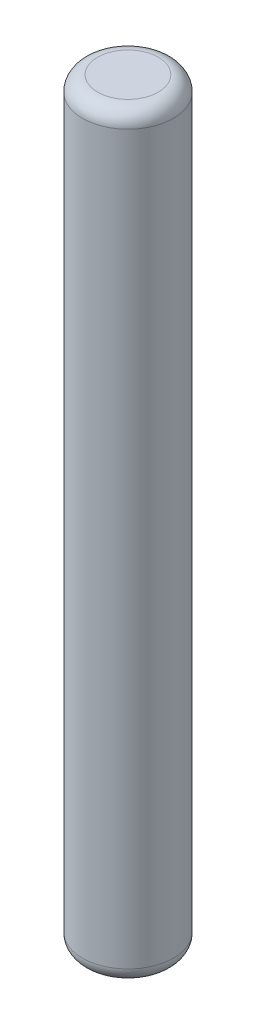
ISO-10303-21;
HEADER;
FILE_DESCRIPTION(('STEP AP214'),'2;1');
FILE_NAME('part.step','',(''),(''),'','','');
FILE_SCHEMA(('AUTOMOTIVE_DESIGN { 1 0 10303 214 1 1 1 1 }'));
ENDSEC;
DATA;
#1=APPLICATION_CONTEXT('core data for automotive mechanical design processes');
#2=APPLICATION_PROTOCOL_DEFINITION('international standard','automotive_design',2000,#1);
#3=PRODUCT_CONTEXT('',#1,'mechanical');
#4=PRODUCT('Part','Part','',(#3));
#5=PRODUCT_RELATED_PRODUCT_CATEGORY('part','',(#4));
#6=PRODUCT_DEFINITION_FORMATION('','',#4);
#7=PRODUCT_DEFINITION_CONTEXT('part definition',#1,'design');
#8=PRODUCT_DEFINITION('design','',#6,#7);
#9=PRODUCT_DEFINITION_SHAPE('','',#8);
#10=(LENGTH_UNIT() NAMED_UNIT(*) SI_UNIT(.MILLI.,.METRE.));
#11=(NAMED_UNIT(*) PLANE_ANGLE_UNIT() SI_UNIT($,.RADIAN.));
#12=(NAMED_UNIT(*) SI_UNIT($,.STERADIAN.) SOLID_ANGLE_UNIT());
#13=UNCERTAINTY_MEASURE_WITH_UNIT(LENGTH_MEASURE(1.E-05),#10,'distance_accuracy_value','');
#14=(GEOMETRIC_REPRESENTATION_CONTEXT(3) GLOBAL_UNCERTAINTY_ASSIGNED_CONTEXT((#13)) GLOBAL_UNIT_ASSIGNED_CONTEXT((#10,
#11,#12)) REPRESENTATION_CONTEXT('',''));
#15=CARTESIAN_POINT('',(0.,0.,0.));
#16=DIRECTION('',(0.,0.,1.));
#17=DIRECTION('',(1.,0.,0.));
#18=AXIS2_PLACEMENT_3D('',#15,#16,#17);
#19=CARTESIAN_POINT('',(0.,25.,0.));
#20=DIRECTION('',(0.,-1.,0.));
#21=DIRECTION('',(0.,0.,-1.));
#22=AXIS2_PLACEMENT_3D('',#19,#20,#21);
#23=CYLINDRICAL_SURFACE('',#22,1.5);
#24=CARTESIAN_POINT('',(0.,0.5,0.));
#25=DIRECTION('',(0.,1.,0.));
#26=DIRECTION('',(0.,0.,1.));
#27=AXIS2_PLACEMENT_3D('',#24,#25,#26);
#28=CIRCLE('',#27,1.5);
#29=CARTESIAN_POINT('',(0.,0.5,1.5));
#30=VERTEX_POINT('',#29);
#31=EDGE_CURVE('E43',#30,#30,#28,.T.);
#32=ORIENTED_EDGE('',*,*,#31,.T.);
#33=EDGE_LOOP('',(#32));
#34=FACE_BOUND('',#33,.T.);
#35=CARTESIAN_POINT('',(0.,24.5,0.));
#36=DIRECTION('',(0.,1.,0.));
#37=DIRECTION('',(0.,0.,1.));
#38=AXIS2_PLACEMENT_3D('',#35,#36,#37);
#39=CIRCLE('',#38,1.5);
#40=CARTESIAN_POINT('',(0.,24.5,1.5));
#41=VERTEX_POINT('',#40);
#42=EDGE_CURVE('E47',#41,#41,#39,.F.);
#43=ORIENTED_EDGE('',*,*,#42,.T.);
#44=EDGE_LOOP('',(#43));
#45=FACE_BOUND('',#44,.T.);
#46=ADVANCED_FACE('F32',(#34,#45),#23,.T.);
#47=CARTESIAN_POINT('',(0.,25.,0.));
#48=DIRECTION('',(0.,1.,0.));
#49=DIRECTION('',(0.,0.,1.));
#50=AXIS2_PLACEMENT_3D('',#47,#48,#49);
#51=PLANE('',#50);
#52=CARTESIAN_POINT('',(0.,25.,0.));
#53=DIRECTION('',(0.,1.,0.));
#54=DIRECTION('',(0.,0.,1.));
#55=AXIS2_PLACEMENT_3D('',#52,#53,#54);
#56=CIRCLE('',#55,1.);
#57=CARTESIAN_POINT('',(0.,25.,1.));
#58=VERTEX_POINT('',#57);
#59=EDGE_CURVE('E10',#58,#58,#56,.T.);
#60=ORIENTED_EDGE('',*,*,#59,.T.);
#61=EDGE_LOOP('',(#60));
#62=FACE_BOUND('',#61,.T.);
#63=ADVANCED_FACE('F63',(#62),#51,.T.);
#64=CARTESIAN_POINT('',(0.,0.,0.));
#65=DIRECTION('',(0.,1.,0.));
#66=DIRECTION('',(0.,0.,1.));
#67=AXIS2_PLACEMENT_3D('',#64,#65,#66);
#68=PLANE('',#67);
#69=CARTESIAN_POINT('',(0.,0.,0.));
#70=DIRECTION('',(0.,1.,0.));
#71=DIRECTION('',(0.,0.,1.));
#72=AXIS2_PLACEMENT_3D('',#69,#70,#71);
#73=CIRCLE('',#72,1.);
#74=CARTESIAN_POINT('',(0.,0.,1.));
#75=VERTEX_POINT('',#74);
#76=EDGE_CURVE('E39',#75,#75,#73,.F.);
#77=ORIENTED_EDGE('',*,*,#76,.T.);
#78=EDGE_LOOP('',(#77));
#79=FACE_BOUND('',#78,.T.);
#80=ADVANCED_FACE('F60',(#79),#68,.F.);
#81=CARTESIAN_POINT('',(0.,0.5,0.));
#82=DIRECTION('',(0.,1.,0.));
#83=DIRECTION('',(0.,0.,1.));
#84=AXIS2_PLACEMENT_3D('',#81,#82,#83);
#85=TOROIDAL_SURFACE('',#84,1.,0.5);
#86=ORIENTED_EDGE('',*,*,#76,.F.);
#87=EDGE_LOOP('',(#86));
#88=FACE_BOUND('',#87,.T.);
#89=ORIENTED_EDGE('',*,*,#31,.F.);
#90=EDGE_LOOP('',(#89));
#91=FACE_BOUND('',#90,.T.);
#92=ADVANCED_FACE('F56',(#88,#91),#85,.T.);
#93=CARTESIAN_POINT('',(0.,24.5,0.));
#94=DIRECTION('',(0.,1.,0.));
#95=DIRECTION('',(0.,0.,1.));
#96=AXIS2_PLACEMENT_3D('',#93,#94,#95);
#97=TOROIDAL_SURFACE('',#96,1.,0.5);
#98=ORIENTED_EDGE('',*,*,#42,.F.);
#99=EDGE_LOOP('',(#98));
#100=FACE_BOUND('',#99,.T.);
#101=ORIENTED_EDGE('',*,*,#59,.F.);
#102=EDGE_LOOP('',(#101));
#103=FACE_BOUND('',#102,.T.);
#104=ADVANCED_FACE('F34',(#100,#103),#97,.T.);
#105=CLOSED_SHELL('',(#46,#63,#80,#92,#104));
#106=MANIFOLD_SOLID_BREP('B2',#105);
#107=ADVANCED_BREP_SHAPE_REPRESENTATION('',(#18,#106),#14);
#108=SHAPE_DEFINITION_REPRESENTATION(#9,#107);
ENDSEC;
END-ISO-10303-21;
